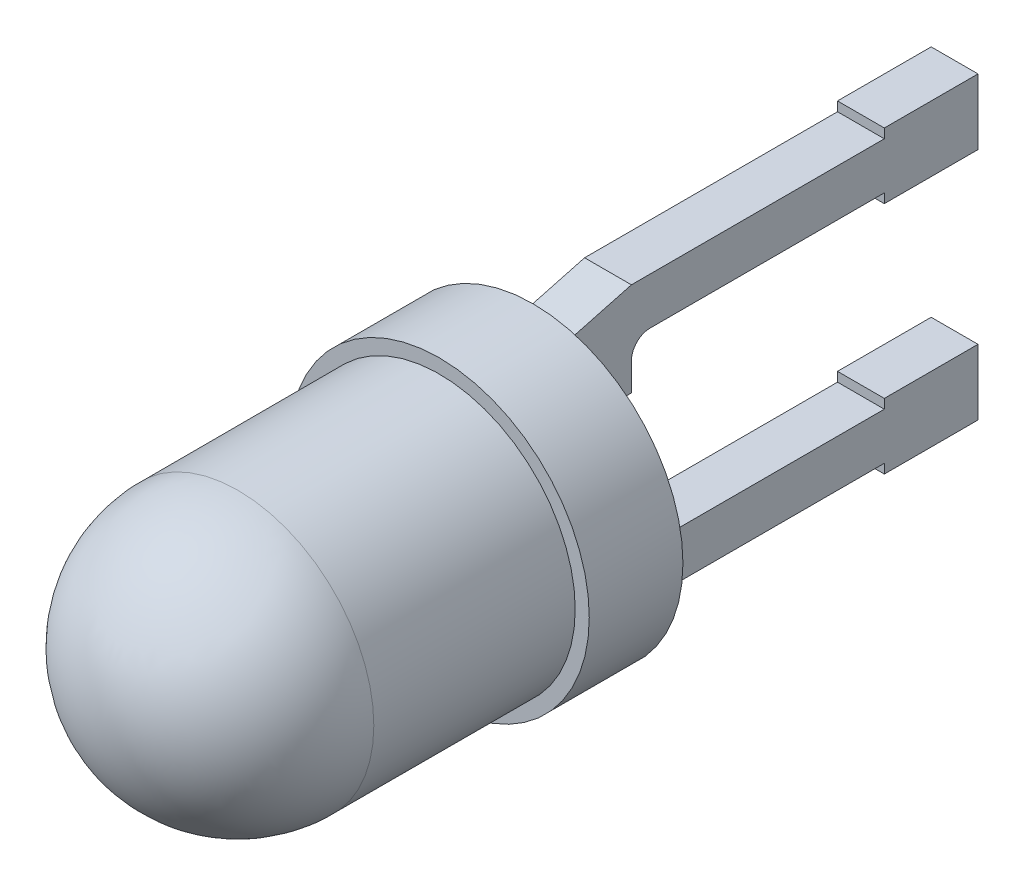
ISO-10303-21;
HEADER;
FILE_DESCRIPTION(('STEP AP214'),'2;1');
FILE_NAME('part.step','',(''),(''),'','','');
FILE_SCHEMA(('AUTOMOTIVE_DESIGN { 1 0 10303 214 1 1 1 1 }'));
ENDSEC;
DATA;
#1=APPLICATION_CONTEXT('core data for automotive mechanical design processes');
#2=APPLICATION_PROTOCOL_DEFINITION('international standard','automotive_design',2000,#1);
#3=PRODUCT_CONTEXT('',#1,'mechanical');
#4=PRODUCT('Part','Part','',(#3));
#5=PRODUCT_RELATED_PRODUCT_CATEGORY('part','',(#4));
#6=PRODUCT_DEFINITION_FORMATION('','',#4);
#7=PRODUCT_DEFINITION_CONTEXT('part definition',#1,'design');
#8=PRODUCT_DEFINITION('design','',#6,#7);
#9=PRODUCT_DEFINITION_SHAPE('','',#8);
#10=(LENGTH_UNIT() NAMED_UNIT(*) SI_UNIT(.MILLI.,.METRE.));
#11=(NAMED_UNIT(*) PLANE_ANGLE_UNIT() SI_UNIT($,.RADIAN.));
#12=(NAMED_UNIT(*) SI_UNIT($,.STERADIAN.) SOLID_ANGLE_UNIT());
#13=UNCERTAINTY_MEASURE_WITH_UNIT(LENGTH_MEASURE(1.E-05),#10,'distance_accuracy_value','');
#14=(GEOMETRIC_REPRESENTATION_CONTEXT(3) GLOBAL_UNCERTAINTY_ASSIGNED_CONTEXT((#13)) GLOBAL_UNIT_ASSIGNED_CONTEXT((#10,
#11,#12)) REPRESENTATION_CONTEXT('',''));
#15=CARTESIAN_POINT('',(0.,0.,0.));
#16=DIRECTION('',(0.,0.,1.));
#17=DIRECTION('',(1.,0.,0.));
#18=AXIS2_PLACEMENT_3D('',#15,#16,#17);
#19=CARTESIAN_POINT('',(-0.25,0.,0.));
#20=DIRECTION('',(-1.,0.,0.));
#21=DIRECTION('',(0.,0.,1.));
#22=AXIS2_PLACEMENT_3D('',#19,#20,#21);
#23=PLANE('',#22);
#24=DIRECTION('',(0.,0.,1.));
#25=VECTOR('',#24,1.);
#26=CARTESIAN_POINT('',(-0.25,-0.9000000004,0.));
#27=LINE('',#26,#25);
#28=CARTESIAN_POINT('',(-0.25,-0.900000000133333,-3.50000000033333));
#29=VERTEX_POINT('',#28);
#30=CARTESIAN_POINT('',(-0.25,-0.9000000004,-4.499999994));
#31=VERTEX_POINT('',#30);
#32=EDGE_CURVE('E264',#29,#31,#27,.F.);
#33=ORIENTED_EDGE('',*,*,#32,.T.);
#34=DIRECTION('',(0.,1.,0.));
#35=VECTOR('',#34,1.);
#36=CARTESIAN_POINT('',(-0.25,0.,-4.5));
#37=LINE('',#36,#35);
#38=CARTESIAN_POINT('',(-0.25,-1.6,-4.4999999985));
#39=VERTEX_POINT('',#38);
#40=EDGE_CURVE('E312',#39,#31,#37,.T.);
#41=ORIENTED_EDGE('',*,*,#40,.F.);
#42=DIRECTION('',(0.,0.,-1.));
#43=VECTOR('',#42,1.);
#44=CARTESIAN_POINT('',(-0.25,-1.6,0.));
#45=LINE('',#44,#43);
#46=CARTESIAN_POINT('',(-0.25,-1.6,-3.5000000005));
#47=VERTEX_POINT('',#46);
#48=EDGE_CURVE('E322',#47,#39,#45,.T.);
#49=ORIENTED_EDGE('',*,*,#48,.F.);
#50=DIRECTION('',(0.,1.,0.));
#51=VECTOR('',#50,1.);
#52=CARTESIAN_POINT('',(-0.25,0.,-3.5));
#53=LINE('',#52,#51);
#54=CARTESIAN_POINT('',(-0.25,-1.5,-3.50000000025));
#55=VERTEX_POINT('',#54);
#56=EDGE_CURVE('E329',#55,#47,#53,.F.);
#57=ORIENTED_EDGE('',*,*,#56,.F.);
#58=DIRECTION('',(0.,0.,-1.));
#59=VECTOR('',#58,1.);
#60=CARTESIAN_POINT('',(-0.25,-1.5,0.));
#61=LINE('',#60,#59);
#62=CARTESIAN_POINT('',(-0.25,-1.49999999985994,-0.799999999912528));
#63=VERTEX_POINT('',#62);
#64=EDGE_CURVE('E228',#63,#55,#61,.T.);
#65=ORIENTED_EDGE('',*,*,#64,.F.);
#66=DIRECTION('',(0.,0.258819045307522,0.965925826234139));
#67=VECTOR('',#66,1.);
#68=CARTESIAN_POINT('',(-0.25,-1.5,-0.7999999995));
#69=LINE('',#68,#67);
#70=CARTESIAN_POINT('',(-0.250000000325,-1.28564064567456,-6.9649347596202E-12));
#71=VERTEX_POINT('',#70);
#72=EDGE_CURVE('E262',#63,#71,#69,.T.);
#73=ORIENTED_EDGE('',*,*,#72,.T.);
#74=DIRECTION('',(0.,1.,0.));
#75=VECTOR('',#74,1.);
#76=CARTESIAN_POINT('',(-0.25,0.,2.649969133E-11));
#77=LINE('',#76,#75);
#78=CARTESIAN_POINT('',(-0.25,-0.5,2.649969133E-11));
#79=VERTEX_POINT('',#78);
#80=EDGE_CURVE('E244',#71,#79,#77,.T.);
#81=ORIENTED_EDGE('',*,*,#80,.T.);
#82=DIRECTION('',(0.,0.,1.));
#83=VECTOR('',#82,1.);
#84=CARTESIAN_POINT('',(-0.25,-0.5,0.));
#85=LINE('',#84,#83);
#86=CARTESIAN_POINT('',(-0.25,-0.5,-0.799999999833333));
#87=VERTEX_POINT('',#86);
#88=EDGE_CURVE('E225',#79,#87,#85,.F.);
#89=ORIENTED_EDGE('',*,*,#88,.T.);
#90=DIRECTION('',(0.,1.,0.));
#91=VECTOR('',#90,1.);
#92=CARTESIAN_POINT('',(-0.25,0.,-0.8));
#93=LINE('',#92,#91);
#94=CARTESIAN_POINT('',(-0.25,-0.8,-0.8));
#95=VERTEX_POINT('',#94);
#96=EDGE_CURVE('E219',#95,#87,#93,.T.);
#97=ORIENTED_EDGE('',*,*,#96,.F.);
#98=CARTESIAN_POINT('',(-0.25,-0.8,-1.));
#99=DIRECTION('',(-1.,0.,0.));
#100=DIRECTION('',(0.,0.,1.));
#101=AXIS2_PLACEMENT_3D('',#98,#99,#100);
#102=CIRCLE('',#101,0.2);
#103=CARTESIAN_POINT('',(-0.25,-1.,-1.));
#104=VERTEX_POINT('',#103);
#105=EDGE_CURVE('E206',#95,#104,#102,.F.);
#106=ORIENTED_EDGE('',*,*,#105,.T.);
#107=DIRECTION('',(0.,0.,1.));
#108=VECTOR('',#107,1.);
#109=CARTESIAN_POINT('',(-0.25,-1.,0.));
#110=LINE('',#109,#108);
#111=CARTESIAN_POINT('',(-0.25,-1.,-3.5));
#112=VERTEX_POINT('',#111);
#113=EDGE_CURVE('E200',#112,#104,#110,.T.);
#114=ORIENTED_EDGE('',*,*,#113,.F.);
#115=DIRECTION('',(0.,1.,0.));
#116=VECTOR('',#115,1.);
#117=CARTESIAN_POINT('',(-0.25,0.,-3.5));
#118=LINE('',#117,#116);
#119=EDGE_CURVE('E238',#29,#112,#118,.F.);
#120=ORIENTED_EDGE('',*,*,#119,.F.);
#121=EDGE_LOOP('',(#33,#41,#49,#57,#65,#73,#81,#89,#97,#106,#114,#120));
#122=FACE_BOUND('',#121,.T.);
#123=ADVANCED_FACE('F38',(#122),#23,.T.);
#124=CARTESIAN_POINT('',(-0.25,0.,0.));
#125=DIRECTION('',(-1.,0.,0.));
#126=DIRECTION('',(0.,0.,1.));
#127=AXIS2_PLACEMENT_3D('',#124,#125,#126);
#128=PLANE('',#127);
#129=DIRECTION('',(0.,1.,0.));
#130=VECTOR('',#129,1.);
#131=CARTESIAN_POINT('',(-0.25,0.,-4.5));
#132=LINE('',#131,#130);
#133=CARTESIAN_POINT('',(-0.25,0.9000000001,-4.50000000225));
#134=VERTEX_POINT('',#133);
#135=CARTESIAN_POINT('',(-0.25,1.6,-4.5000000045));
#136=VERTEX_POINT('',#135);
#137=EDGE_CURVE('E396',#134,#136,#132,.T.);
#138=ORIENTED_EDGE('',*,*,#137,.F.);
#139=DIRECTION('',(0.,0.,-1.));
#140=VECTOR('',#139,1.);
#141=CARTESIAN_POINT('',(-0.25,0.9,0.));
#142=LINE('',#141,#140);
#143=CARTESIAN_POINT('',(-0.25,0.9000000002,-3.500000005));
#144=VERTEX_POINT('',#143);
#145=EDGE_CURVE('E255',#144,#134,#142,.T.);
#146=ORIENTED_EDGE('',*,*,#145,.F.);
#147=DIRECTION('',(0.,1.,0.));
#148=VECTOR('',#147,1.);
#149=CARTESIAN_POINT('',(-0.25,0.,-3.5));
#150=LINE('',#149,#148);
#151=CARTESIAN_POINT('',(-0.25,1.00000000016667,-3.50000000166667));
#152=VERTEX_POINT('',#151);
#153=EDGE_CURVE('E253',#152,#144,#150,.F.);
#154=ORIENTED_EDGE('',*,*,#153,.F.);
#155=DIRECTION('',(0.,0.,-1.));
#156=VECTOR('',#155,1.);
#157=CARTESIAN_POINT('',(-0.25,1.,0.));
#158=LINE('',#157,#156);
#159=CARTESIAN_POINT('',(-0.25,1.,-1.));
#160=VERTEX_POINT('',#159);
#161=EDGE_CURVE('E247',#160,#152,#158,.T.);
#162=ORIENTED_EDGE('',*,*,#161,.F.);
#163=CARTESIAN_POINT('',(-0.25,0.8,-1.));
#164=DIRECTION('',(1.,0.,0.));
#165=DIRECTION('',(0.,0.,-1.));
#166=AXIS2_PLACEMENT_3D('',#163,#164,#165);
#167=CIRCLE('',#166,0.2);
#168=CARTESIAN_POINT('',(-0.25,0.8,-0.800000005));
#169=VERTEX_POINT('',#168);
#170=EDGE_CURVE('E280',#160,#169,#167,.T.);
#171=ORIENTED_EDGE('',*,*,#170,.T.);
#172=DIRECTION('',(0.,1.,0.));
#173=VECTOR('',#172,1.);
#174=CARTESIAN_POINT('',(-0.25,0.,-0.80000001));
#175=LINE('',#174,#173);
#176=CARTESIAN_POINT('',(-0.25,0.5,-0.800000005));
#177=VERTEX_POINT('',#176);
#178=EDGE_CURVE('E242',#169,#177,#175,.F.);
#179=ORIENTED_EDGE('',*,*,#178,.T.);
#180=DIRECTION('',(0.,0.,1.));
#181=VECTOR('',#180,1.);
#182=CARTESIAN_POINT('',(-0.25,0.5,0.));
#183=LINE('',#182,#181);
#184=CARTESIAN_POINT('',(-0.250000000325,0.499999999825,1.399946825E-11));
#185=VERTEX_POINT('',#184);
#186=EDGE_CURVE('E241',#177,#185,#183,.T.);
#187=ORIENTED_EDGE('',*,*,#186,.T.);
#188=DIRECTION('',(0.,1.,0.));
#189=VECTOR('',#188,1.);
#190=CARTESIAN_POINT('',(-0.25,0.,2.79989365E-11));
#191=LINE('',#190,#189);
#192=CARTESIAN_POINT('',(-0.250000000325,1.28564064567445,-5.80333535264917E-12));
#193=VERTEX_POINT('',#192);
#194=EDGE_CURVE('E239',#185,#193,#191,.T.);
#195=ORIENTED_EDGE('',*,*,#194,.T.);
#196=DIRECTION('',(0.,0.258819042137625,-0.96592582708351));
#197=VECTOR('',#196,1.);
#198=CARTESIAN_POINT('',(-0.25,1.285640646,2.79989365E-11));
#199=LINE('',#198,#197);
#200=CARTESIAN_POINT('',(-0.25,1.49999999992997,-0.800000005018764));
#201=VERTEX_POINT('',#200);
#202=EDGE_CURVE('E236',#193,#201,#199,.T.);
#203=ORIENTED_EDGE('',*,*,#202,.T.);
#204=DIRECTION('',(0.,0.,1.));
#205=VECTOR('',#204,1.);
#206=CARTESIAN_POINT('',(-0.25,1.5,0.));
#207=LINE('',#206,#205);
#208=CARTESIAN_POINT('',(-0.25,1.5,-3.5000000025));
#209=VERTEX_POINT('',#208);
#210=EDGE_CURVE('E380',#209,#201,#207,.T.);
#211=ORIENTED_EDGE('',*,*,#210,.F.);
#212=DIRECTION('',(0.,1.,0.));
#213=VECTOR('',#212,1.);
#214=CARTESIAN_POINT('',(-0.25,0.,-3.5));
#215=LINE('',#214,#213);
#216=CARTESIAN_POINT('',(-0.25,1.6,-3.5000000025));
#217=VERTEX_POINT('',#216);
#218=EDGE_CURVE('E386',#217,#209,#215,.F.);
#219=ORIENTED_EDGE('',*,*,#218,.F.);
#220=DIRECTION('',(0.,0.,1.));
#221=VECTOR('',#220,1.);
#222=CARTESIAN_POINT('',(-0.25,1.6,0.));
#223=LINE('',#222,#221);
#224=EDGE_CURVE('E394',#136,#217,#223,.T.);
#225=ORIENTED_EDGE('',*,*,#224,.F.);
#226=EDGE_LOOP('',(#138,#146,#154,#162,#171,#179,#187,#195,#203,#211,#219,#225));
#227=FACE_BOUND('',#226,.T.);
#228=ADVANCED_FACE('F483',(#227),#128,.T.);
#229=CARTESIAN_POINT('',(0.,0.,-3.5));
#230=DIRECTION('',(0.,0.,1.));
#231=DIRECTION('',(1.,0.,0.));
#232=AXIS2_PLACEMENT_3D('',#229,#230,#231);
#233=PLANE('',#232);
#234=DIRECTION('',(1.,0.,0.));
#235=VECTOR('',#234,1.);
#236=CARTESIAN_POINT('',(0.,-1.,-3.5));
#237=LINE('',#236,#235);
#238=CARTESIAN_POINT('',(0.25,-1.,-3.50000000066667));
#239=VERTEX_POINT('',#238);
#240=EDGE_CURVE('E259',#239,#112,#237,.F.);
#241=ORIENTED_EDGE('',*,*,#240,.F.);
#242=DIRECTION('',(0.,1.,0.));
#243=VECTOR('',#242,1.);
#244=CARTESIAN_POINT('',(0.25,0.,-3.500000001));
#245=LINE('',#244,#243);
#246=CARTESIAN_POINT('',(0.25,-0.9000000002,-3.50000000066667));
#247=VERTEX_POINT('',#246);
#248=EDGE_CURVE('E337',#247,#239,#245,.F.);
#249=ORIENTED_EDGE('',*,*,#248,.F.);
#250=DIRECTION('',(1.,0.,0.));
#251=VECTOR('',#250,1.);
#252=CARTESIAN_POINT('',(0.,-0.9,-3.5));
#253=LINE('',#252,#251);
#254=EDGE_CURVE('E281',#29,#247,#253,.T.);
#255=ORIENTED_EDGE('',*,*,#254,.F.);
#256=ORIENTED_EDGE('',*,*,#119,.T.);
#257=EDGE_LOOP('',(#241,#249,#255,#256));
#258=FACE_BOUND('',#257,.T.);
#259=ADVANCED_FACE('F707',(#258),#233,.T.);
#260=CARTESIAN_POINT('',(0.,-1.,0.));
#261=DIRECTION('',(0.,1.,0.));
#262=DIRECTION('',(0.,0.,1.));
#263=AXIS2_PLACEMENT_3D('',#260,#261,#262);
#264=PLANE('',#263);
#265=DIRECTION('',(-1.,0.,0.));
#266=VECTOR('',#265,1.);
#267=CARTESIAN_POINT('',(0.,-1.,-1.));
#268=LINE('',#267,#266);
#269=CARTESIAN_POINT('',(0.25,-1.,-1.));
#270=VERTEX_POINT('',#269);
#271=EDGE_CURVE('E211',#104,#270,#268,.F.);
#272=ORIENTED_EDGE('',*,*,#271,.T.);
#273=DIRECTION('',(0.,0.,-1.));
#274=VECTOR('',#273,1.);
#275=CARTESIAN_POINT('',(0.25,-1.,0.));
#276=LINE('',#275,#274);
#277=EDGE_CURVE('E310',#239,#270,#276,.F.);
#278=ORIENTED_EDGE('',*,*,#277,.F.);
#279=ORIENTED_EDGE('',*,*,#240,.T.);
#280=ORIENTED_EDGE('',*,*,#113,.T.);
#281=EDGE_LOOP('',(#272,#278,#279,#280));
#282=FACE_BOUND('',#281,.T.);
#283=ADVANCED_FACE('F698',(#282),#264,.T.);
#284=CARTESIAN_POINT('',(0.25,-0.8,-1.));
#285=DIRECTION('',(-1.,0.,0.));
#286=DIRECTION('',(0.,0.,1.));
#287=AXIS2_PLACEMENT_3D('',#284,#285,#286);
#288=CYLINDRICAL_SURFACE('',#287,0.2);
#289=ORIENTED_EDGE('',*,*,#271,.F.);
#290=ORIENTED_EDGE('',*,*,#105,.F.);
#291=DIRECTION('',(-1.,0.,0.));
#292=VECTOR('',#291,1.);
#293=CARTESIAN_POINT('',(0.,-0.8,-0.8));
#294=LINE('',#293,#292);
#295=CARTESIAN_POINT('',(0.25,-0.8,-0.79999999975));
#296=VERTEX_POINT('',#295);
#297=EDGE_CURVE('E209',#296,#95,#294,.T.);
#298=ORIENTED_EDGE('',*,*,#297,.F.);
#299=CARTESIAN_POINT('',(0.25,-0.8,-1.));
#300=DIRECTION('',(-1.,0.,0.));
#301=DIRECTION('',(0.,0.,1.));
#302=AXIS2_PLACEMENT_3D('',#299,#300,#301);
#303=CIRCLE('',#302,0.2);
#304=EDGE_CURVE('E308',#270,#296,#303,.T.);
#305=ORIENTED_EDGE('',*,*,#304,.F.);
#306=EDGE_LOOP('',(#289,#290,#298,#305));
#307=FACE_BOUND('',#306,.T.);
#308=ADVANCED_FACE('F208',(#307),#288,.F.);
#309=CARTESIAN_POINT('',(0.,0.,-0.8));
#310=DIRECTION('',(0.,0.,-1.));
#311=DIRECTION('',(-1.,0.,0.));
#312=AXIS2_PLACEMENT_3D('',#309,#310,#311);
#313=PLANE('',#312);
#314=ORIENTED_EDGE('',*,*,#297,.T.);
#315=ORIENTED_EDGE('',*,*,#96,.T.);
#316=DIRECTION('',(1.,0.,0.));
#317=VECTOR('',#316,1.);
#318=CARTESIAN_POINT('',(0.,-0.5,-0.8));
#319=LINE('',#318,#317);
#320=CARTESIAN_POINT('',(0.25,-0.5,-0.799999999666667));
#321=VERTEX_POINT('',#320);
#322=EDGE_CURVE('E335',#321,#87,#319,.F.);
#323=ORIENTED_EDGE('',*,*,#322,.F.);
#324=DIRECTION('',(0.,1.,0.));
#325=VECTOR('',#324,1.);
#326=CARTESIAN_POINT('',(0.25,0.,-0.7999999995));
#327=LINE('',#326,#325);
#328=EDGE_CURVE('E221',#296,#321,#327,.T.);
#329=ORIENTED_EDGE('',*,*,#328,.F.);
#330=EDGE_LOOP('',(#314,#315,#323,#329));
#331=FACE_BOUND('',#330,.T.);
#332=ADVANCED_FACE('F217',(#331),#313,.T.);
#333=CARTESIAN_POINT('',(0.,-1.5,0.));
#334=DIRECTION('',(0.,-1.,0.));
#335=DIRECTION('',(0.,0.,-1.));
#336=AXIS2_PLACEMENT_3D('',#333,#334,#335);
#337=PLANE('',#336);
#338=DIRECTION('',(1.,0.,0.));
#339=VECTOR('',#338,1.);
#340=CARTESIAN_POINT('',(0.,-1.5,-3.5));
#341=LINE('',#340,#339);
#342=CARTESIAN_POINT('',(0.25,-1.5,-3.50000000025));
#343=VERTEX_POINT('',#342);
#344=EDGE_CURVE('E331',#343,#55,#341,.F.);
#345=ORIENTED_EDGE('',*,*,#344,.F.);
#346=DIRECTION('',(0.,0.,-1.));
#347=VECTOR('',#346,1.);
#348=CARTESIAN_POINT('',(0.25,-1.5,0.));
#349=LINE('',#348,#347);
#350=CARTESIAN_POINT('',(0.25,-1.49999999992997,-0.799999999893764));
#351=VERTEX_POINT('',#350);
#352=EDGE_CURVE('E343',#351,#343,#349,.T.);
#353=ORIENTED_EDGE('',*,*,#352,.F.);
#354=DIRECTION('',(1.,0.,0.));
#355=VECTOR('',#354,1.);
#356=CARTESIAN_POINT('',(0.,-1.5,-0.8));
#357=LINE('',#356,#355);
#358=EDGE_CURVE('E226',#351,#63,#357,.F.);
#359=ORIENTED_EDGE('',*,*,#358,.T.);
#360=ORIENTED_EDGE('',*,*,#64,.T.);
#361=EDGE_LOOP('',(#345,#353,#359,#360));
#362=FACE_BOUND('',#361,.T.);
#363=ADVANCED_FACE('F671',(#362),#337,.T.);
#364=CARTESIAN_POINT('',(0.,0.,-3.5));
#365=DIRECTION('',(0.,0.,1.));
#366=DIRECTION('',(1.,0.,0.));
#367=AXIS2_PLACEMENT_3D('',#364,#365,#366);
#368=PLANE('',#367);
#369=ORIENTED_EDGE('',*,*,#344,.T.);
#370=ORIENTED_EDGE('',*,*,#56,.T.);
#371=DIRECTION('',(1.,0.,0.));
#372=VECTOR('',#371,1.);
#373=CARTESIAN_POINT('',(0.,-1.6,-3.5));
#374=LINE('',#373,#372);
#375=CARTESIAN_POINT('',(0.25,-1.6,-3.50000000025));
#376=VERTEX_POINT('',#375);
#377=EDGE_CURVE('E318',#376,#47,#374,.F.);
#378=ORIENTED_EDGE('',*,*,#377,.F.);
#379=DIRECTION('',(0.,1.,0.));
#380=VECTOR('',#379,1.);
#381=CARTESIAN_POINT('',(0.25,0.,-3.500000001));
#382=LINE('',#381,#380);
#383=EDGE_CURVE('E367',#343,#376,#382,.F.);
#384=ORIENTED_EDGE('',*,*,#383,.F.);
#385=EDGE_LOOP('',(#369,#370,#378,#384));
#386=FACE_BOUND('',#385,.T.);
#387=ADVANCED_FACE('F661',(#386),#368,.T.);
#388=CARTESIAN_POINT('',(0.,-1.6,0.));
#389=DIRECTION('',(0.,-1.,0.));
#390=DIRECTION('',(0.,0.,-1.));
#391=AXIS2_PLACEMENT_3D('',#388,#389,#390);
#392=PLANE('',#391);
#393=DIRECTION('',(0.,0.,-1.));
#394=VECTOR('',#393,1.);
#395=CARTESIAN_POINT('',(0.25,-1.6,0.));
#396=LINE('',#395,#394);
#397=CARTESIAN_POINT('',(0.25,-1.6,-4.4999999985));
#398=VERTEX_POINT('',#397);
#399=EDGE_CURVE('E364',#376,#398,#396,.T.);
#400=ORIENTED_EDGE('',*,*,#399,.F.);
#401=ORIENTED_EDGE('',*,*,#377,.T.);
#402=ORIENTED_EDGE('',*,*,#48,.T.);
#403=DIRECTION('',(-1.,0.,0.));
#404=VECTOR('',#403,1.);
#405=CARTESIAN_POINT('',(0.,-1.6,-4.5));
#406=LINE('',#405,#404);
#407=EDGE_CURVE('E313',#398,#39,#406,.T.);
#408=ORIENTED_EDGE('',*,*,#407,.F.);
#409=EDGE_LOOP('',(#400,#401,#402,#408));
#410=FACE_BOUND('',#409,.T.);
#411=ADVANCED_FACE('F653',(#410),#392,.T.);
#412=CARTESIAN_POINT('',(0.,0.,-4.5));
#413=DIRECTION('',(0.,0.,-1.));
#414=DIRECTION('',(-1.,0.,0.));
#415=AXIS2_PLACEMENT_3D('',#412,#413,#414);
#416=PLANE('',#415);
#417=DIRECTION('',(0.,1.,0.));
#418=VECTOR('',#417,1.);
#419=CARTESIAN_POINT('',(0.25,0.,-4.499999994));
#420=LINE('',#419,#418);
#421=CARTESIAN_POINT('',(0.25,-0.9000000001,-4.4999999985));
#422=VERTEX_POINT('',#421);
#423=EDGE_CURVE('E357',#398,#422,#420,.T.);
#424=ORIENTED_EDGE('',*,*,#423,.F.);
#425=ORIENTED_EDGE('',*,*,#407,.T.);
#426=ORIENTED_EDGE('',*,*,#40,.T.);
#427=DIRECTION('',(1.,0.,0.));
#428=VECTOR('',#427,1.);
#429=CARTESIAN_POINT('',(0.,-0.9,-4.5));
#430=LINE('',#429,#428);
#431=EDGE_CURVE('E277',#422,#31,#430,.F.);
#432=ORIENTED_EDGE('',*,*,#431,.F.);
#433=EDGE_LOOP('',(#424,#425,#426,#432));
#434=FACE_BOUND('',#433,.T.);
#435=ADVANCED_FACE('F642',(#434),#416,.T.);
#436=CARTESIAN_POINT('',(0.,-0.9,0.));
#437=DIRECTION('',(0.,1.,0.));
#438=DIRECTION('',(0.,0.,1.));
#439=AXIS2_PLACEMENT_3D('',#436,#437,#438);
#440=PLANE('',#439);
#441=DIRECTION('',(0.,0.,-1.));
#442=VECTOR('',#441,1.);
#443=CARTESIAN_POINT('',(0.25,-0.9000000004,0.));
#444=LINE('',#443,#442);
#445=EDGE_CURVE('E353',#422,#247,#444,.F.);
#446=ORIENTED_EDGE('',*,*,#445,.F.);
#447=ORIENTED_EDGE('',*,*,#431,.T.);
#448=ORIENTED_EDGE('',*,*,#32,.F.);
#449=ORIENTED_EDGE('',*,*,#254,.T.);
#450=EDGE_LOOP('',(#446,#447,#448,#449));
#451=FACE_BOUND('',#450,.T.);
#452=ADVANCED_FACE('F633',(#451),#440,.T.);
#453=CARTESIAN_POINT('',(-0.25,0.8,-1.));
#454=DIRECTION('',(1.,0.,0.));
#455=DIRECTION('',(0.,0.,-1.));
#456=AXIS2_PLACEMENT_3D('',#453,#454,#455);
#457=CYLINDRICAL_SURFACE('',#456,0.2);
#458=DIRECTION('',(1.,0.,0.));
#459=VECTOR('',#458,1.);
#460=CARTESIAN_POINT('',(0.,1.,-1.));
#461=LINE('',#460,#459);
#462=CARTESIAN_POINT('',(0.25,1.0000000005,-1.));
#463=VERTEX_POINT('',#462);
#464=EDGE_CURVE('E250',#463,#160,#461,.F.);
#465=ORIENTED_EDGE('',*,*,#464,.F.);
#466=CARTESIAN_POINT('',(0.25,0.8,-1.));
#467=DIRECTION('',(1.,0.,0.));
#468=DIRECTION('',(0.,0.,-1.));
#469=AXIS2_PLACEMENT_3D('',#466,#467,#468);
#470=CIRCLE('',#469,0.2);
#471=CARTESIAN_POINT('',(0.25,0.8,-0.800000005));
#472=VERTEX_POINT('',#471);
#473=EDGE_CURVE('E304',#472,#463,#470,.F.);
#474=ORIENTED_EDGE('',*,*,#473,.F.);
#475=DIRECTION('',(-1.,0.,0.));
#476=VECTOR('',#475,1.);
#477=CARTESIAN_POINT('',(0.,0.8,-0.8));
#478=LINE('',#477,#476);
#479=EDGE_CURVE('E338',#169,#472,#478,.F.);
#480=ORIENTED_EDGE('',*,*,#479,.F.);
#481=ORIENTED_EDGE('',*,*,#170,.F.);
#482=EDGE_LOOP('',(#465,#474,#480,#481));
#483=FACE_BOUND('',#482,.T.);
#484=ADVANCED_FACE('F493',(#483),#457,.F.);
#485=CARTESIAN_POINT('',(0.,1.,0.));
#486=DIRECTION('',(0.,-1.,0.));
#487=DIRECTION('',(0.,0.,-1.));
#488=AXIS2_PLACEMENT_3D('',#485,#486,#487);
#489=PLANE('',#488);
#490=ORIENTED_EDGE('',*,*,#464,.T.);
#491=ORIENTED_EDGE('',*,*,#161,.T.);
#492=DIRECTION('',(1.,0.,0.));
#493=VECTOR('',#492,1.);
#494=CARTESIAN_POINT('',(0.,1.,-3.5));
#495=LINE('',#494,#493);
#496=CARTESIAN_POINT('',(0.25,1.00000000066667,-3.50000000666667));
#497=VERTEX_POINT('',#496);
#498=EDGE_CURVE('E249',#497,#152,#495,.F.);
#499=ORIENTED_EDGE('',*,*,#498,.F.);
#500=DIRECTION('',(0.,0.,-1.));
#501=VECTOR('',#500,1.);
#502=CARTESIAN_POINT('',(0.25,1.000000001,0.));
#503=LINE('',#502,#501);
#504=EDGE_CURVE('E306',#463,#497,#503,.T.);
#505=ORIENTED_EDGE('',*,*,#504,.F.);
#506=EDGE_LOOP('',(#490,#491,#499,#505));
#507=FACE_BOUND('',#506,.T.);
#508=ADVANCED_FACE('F495',(#507),#489,.T.);
#509=CARTESIAN_POINT('',(0.,0.,-3.5));
#510=DIRECTION('',(0.,0.,1.));
#511=DIRECTION('',(1.,0.,0.));
#512=AXIS2_PLACEMENT_3D('',#509,#510,#511);
#513=PLANE('',#512);
#514=ORIENTED_EDGE('',*,*,#498,.T.);
#515=ORIENTED_EDGE('',*,*,#153,.T.);
#516=DIRECTION('',(1.,0.,0.));
#517=VECTOR('',#516,1.);
#518=CARTESIAN_POINT('',(0.,0.9,-3.5));
#519=LINE('',#518,#517);
#520=CARTESIAN_POINT('',(0.25,0.9000000001,-3.5000000025));
#521=VERTEX_POINT('',#520);
#522=EDGE_CURVE('E401',#521,#144,#519,.F.);
#523=ORIENTED_EDGE('',*,*,#522,.F.);
#524=DIRECTION('',(0.,1.,0.));
#525=VECTOR('',#524,1.);
#526=CARTESIAN_POINT('',(0.25,0.,-3.50000001));
#527=LINE('',#526,#525);
#528=EDGE_CURVE('E412',#497,#521,#527,.F.);
#529=ORIENTED_EDGE('',*,*,#528,.F.);
#530=EDGE_LOOP('',(#514,#515,#523,#529));
#531=FACE_BOUND('',#530,.T.);
#532=ADVANCED_FACE('F500',(#531),#513,.T.);
#533=CARTESIAN_POINT('',(0.,0.9,0.));
#534=DIRECTION('',(0.,-1.,0.));
#535=DIRECTION('',(0.,0.,-1.));
#536=AXIS2_PLACEMENT_3D('',#533,#534,#535);
#537=PLANE('',#536);
#538=DIRECTION('',(0.,0.,-1.));
#539=VECTOR('',#538,1.);
#540=CARTESIAN_POINT('',(0.25,0.9000000004,0.));
#541=LINE('',#540,#539);
#542=CARTESIAN_POINT('',(0.25,0.9000000001,-4.50000000225));
#543=VERTEX_POINT('',#542);
#544=EDGE_CURVE('E414',#521,#543,#541,.T.);
#545=ORIENTED_EDGE('',*,*,#544,.F.);
#546=ORIENTED_EDGE('',*,*,#522,.T.);
#547=ORIENTED_EDGE('',*,*,#145,.T.);
#548=DIRECTION('',(-1.,0.,0.));
#549=VECTOR('',#548,1.);
#550=CARTESIAN_POINT('',(0.,0.9,-4.5));
#551=LINE('',#550,#549);
#552=EDGE_CURVE('E398',#543,#134,#551,.T.);
#553=ORIENTED_EDGE('',*,*,#552,.F.);
#554=EDGE_LOOP('',(#545,#546,#547,#553));
#555=FACE_BOUND('',#554,.T.);
#556=ADVANCED_FACE('F505',(#555),#537,.T.);
#557=CARTESIAN_POINT('',(0.,0.,-4.5));
#558=DIRECTION('',(0.,0.,-1.));
#559=DIRECTION('',(-1.,0.,0.));
#560=AXIS2_PLACEMENT_3D('',#557,#558,#559);
#561=PLANE('',#560);
#562=DIRECTION('',(0.,1.,0.));
#563=VECTOR('',#562,1.);
#564=CARTESIAN_POINT('',(0.25,0.,-4.500000009));
#565=LINE('',#564,#563);
#566=CARTESIAN_POINT('',(0.25,1.6,-4.50000000225));
#567=VERTEX_POINT('',#566);
#568=EDGE_CURVE('E463',#543,#567,#565,.T.);
#569=ORIENTED_EDGE('',*,*,#568,.F.);
#570=ORIENTED_EDGE('',*,*,#552,.T.);
#571=ORIENTED_EDGE('',*,*,#137,.T.);
#572=DIRECTION('',(1.,0.,0.));
#573=VECTOR('',#572,1.);
#574=CARTESIAN_POINT('',(0.,1.6,-4.5));
#575=LINE('',#574,#573);
#576=EDGE_CURVE('E391',#567,#136,#575,.F.);
#577=ORIENTED_EDGE('',*,*,#576,.F.);
#578=EDGE_LOOP('',(#569,#570,#571,#577));
#579=FACE_BOUND('',#578,.T.);
#580=ADVANCED_FACE('F508',(#579),#561,.T.);
#581=CARTESIAN_POINT('',(0.,1.6,0.));
#582=DIRECTION('',(0.,1.,0.));
#583=DIRECTION('',(0.,0.,1.));
#584=AXIS2_PLACEMENT_3D('',#581,#582,#583);
#585=PLANE('',#584);
#586=DIRECTION('',(0.,0.,-1.));
#587=VECTOR('',#586,1.);
#588=CARTESIAN_POINT('',(0.25,1.6,0.));
#589=LINE('',#588,#587);
#590=CARTESIAN_POINT('',(0.25,1.6,-3.5000000025));
#591=VERTEX_POINT('',#590);
#592=EDGE_CURVE('E461',#567,#591,#589,.F.);
#593=ORIENTED_EDGE('',*,*,#592,.F.);
#594=ORIENTED_EDGE('',*,*,#576,.T.);
#595=ORIENTED_EDGE('',*,*,#224,.T.);
#596=DIRECTION('',(1.,0.,0.));
#597=VECTOR('',#596,1.);
#598=CARTESIAN_POINT('',(0.,1.6,-3.5));
#599=LINE('',#598,#597);
#600=EDGE_CURVE('E388',#591,#217,#599,.F.);
#601=ORIENTED_EDGE('',*,*,#600,.F.);
#602=EDGE_LOOP('',(#593,#594,#595,#601));
#603=FACE_BOUND('',#602,.T.);
#604=ADVANCED_FACE('F512',(#603),#585,.T.);
#605=CARTESIAN_POINT('',(0.,0.,-3.5));
#606=DIRECTION('',(0.,0.,1.));
#607=DIRECTION('',(1.,0.,0.));
#608=AXIS2_PLACEMENT_3D('',#605,#606,#607);
#609=PLANE('',#608);
#610=DIRECTION('',(1.,0.,0.));
#611=VECTOR('',#610,1.);
#612=CARTESIAN_POINT('',(0.,1.5,-3.5));
#613=LINE('',#612,#611);
#614=CARTESIAN_POINT('',(0.25,1.5,-3.5000000025));
#615=VERTEX_POINT('',#614);
#616=EDGE_CURVE('E383',#615,#209,#613,.F.);
#617=ORIENTED_EDGE('',*,*,#616,.F.);
#618=DIRECTION('',(0.,1.,0.));
#619=VECTOR('',#618,1.);
#620=CARTESIAN_POINT('',(0.25,0.,-3.50000001));
#621=LINE('',#620,#619);
#622=EDGE_CURVE('E459',#591,#615,#621,.F.);
#623=ORIENTED_EDGE('',*,*,#622,.F.);
#624=ORIENTED_EDGE('',*,*,#600,.T.);
#625=ORIENTED_EDGE('',*,*,#218,.T.);
#626=EDGE_LOOP('',(#617,#623,#624,#625));
#627=FACE_BOUND('',#626,.T.);
#628=ADVANCED_FACE('F515',(#627),#609,.T.);
#629=CARTESIAN_POINT('',(0.,1.5,0.));
#630=DIRECTION('',(0.,1.,0.));
#631=DIRECTION('',(0.,0.,1.));
#632=AXIS2_PLACEMENT_3D('',#629,#630,#631);
#633=PLANE('',#632);
#634=ORIENTED_EDGE('',*,*,#616,.T.);
#635=ORIENTED_EDGE('',*,*,#210,.T.);
#636=DIRECTION('',(1.,0.,0.));
#637=VECTOR('',#636,1.);
#638=CARTESIAN_POINT('',(0.,1.49999999971988,-0.800000000075058));
#639=LINE('',#638,#637);
#640=CARTESIAN_POINT('',(0.25,1.49999999992997,-0.800000002518764));
#641=VERTEX_POINT('',#640);
#642=EDGE_CURVE('E362',#641,#201,#639,.F.);
#643=ORIENTED_EDGE('',*,*,#642,.F.);
#644=DIRECTION('',(0.,0.,-1.));
#645=VECTOR('',#644,1.);
#646=CARTESIAN_POINT('',(0.25,1.5,0.));
#647=LINE('',#646,#645);
#648=EDGE_CURVE('E457',#615,#641,#647,.F.);
#649=ORIENTED_EDGE('',*,*,#648,.F.);
#650=EDGE_LOOP('',(#634,#635,#643,#649));
#651=FACE_BOUND('',#650,.T.);
#652=ADVANCED_FACE('F478',(#651),#633,.T.);
#653=CARTESIAN_POINT('',(0.,0.,-0.8));
#654=DIRECTION('',(0.,0.,-1.));
#655=DIRECTION('',(-1.,0.,0.));
#656=AXIS2_PLACEMENT_3D('',#653,#654,#655);
#657=PLANE('',#656);
#658=ORIENTED_EDGE('',*,*,#479,.T.);
#659=DIRECTION('',(0.,1.,0.));
#660=VECTOR('',#659,1.);
#661=CARTESIAN_POINT('',(0.25,0.,-0.80000001));
#662=LINE('',#661,#660);
#663=CARTESIAN_POINT('',(0.25,0.5,-0.80000001));
#664=VERTEX_POINT('',#663);
#665=EDGE_CURVE('E307',#664,#472,#662,.T.);
#666=ORIENTED_EDGE('',*,*,#665,.F.);
#667=DIRECTION('',(1.,0.,0.));
#668=VECTOR('',#667,1.);
#669=CARTESIAN_POINT('',(0.,0.5,-0.8));
#670=LINE('',#669,#668);
#671=EDGE_CURVE('E419',#177,#664,#670,.T.);
#672=ORIENTED_EDGE('',*,*,#671,.F.);
#673=ORIENTED_EDGE('',*,*,#178,.F.);
#674=EDGE_LOOP('',(#658,#666,#672,#673));
#675=FACE_BOUND('',#674,.T.);
#676=ADVANCED_FACE('F488',(#675),#657,.T.);
#677=CARTESIAN_POINT('',(0.,-0.5,0.));
#678=DIRECTION('',(0.,1.,0.));
#679=DIRECTION('',(0.,0.,1.));
#680=AXIS2_PLACEMENT_3D('',#677,#678,#679);
#681=PLANE('',#680);
#682=DIRECTION('',(1.,0.,0.));
#683=VECTOR('',#682,1.);
#684=CARTESIAN_POINT('',(0.,-0.4999999993,0.));
#685=LINE('',#684,#683);
#686=CARTESIAN_POINT('',(0.250000000325,-0.499999999825,9.00002295E-13));
#687=VERTEX_POINT('',#686);
#688=EDGE_CURVE('E287',#79,#687,#685,.T.);
#689=ORIENTED_EDGE('',*,*,#688,.T.);
#690=DIRECTION('',(0.,0.,-1.));
#691=VECTOR('',#690,1.);
#692=CARTESIAN_POINT('',(0.25,-0.5,0.));
#693=LINE('',#692,#691);
#694=EDGE_CURVE('E341',#321,#687,#693,.F.);
#695=ORIENTED_EDGE('',*,*,#694,.F.);
#696=ORIENTED_EDGE('',*,*,#322,.T.);
#697=ORIENTED_EDGE('',*,*,#88,.F.);
#698=EDGE_LOOP('',(#689,#695,#696,#697));
#699=FACE_BOUND('',#698,.T.);
#700=ADVANCED_FACE('F564',(#699),#681,.T.);
#701=CARTESIAN_POINT('',(0.25,0.,0.));
#702=DIRECTION('',(1.,0.,0.));
#703=DIRECTION('',(0.,0.,-1.));
#704=AXIS2_PLACEMENT_3D('',#701,#702,#703);
#705=PLANE('',#704);
#706=ORIENTED_EDGE('',*,*,#399,.T.);
#707=ORIENTED_EDGE('',*,*,#423,.T.);
#708=ORIENTED_EDGE('',*,*,#445,.T.);
#709=ORIENTED_EDGE('',*,*,#248,.T.);
#710=ORIENTED_EDGE('',*,*,#277,.T.);
#711=ORIENTED_EDGE('',*,*,#304,.T.);
#712=ORIENTED_EDGE('',*,*,#328,.T.);
#713=ORIENTED_EDGE('',*,*,#694,.T.);
#714=DIRECTION('',(0.,1.,0.));
#715=VECTOR('',#714,1.);
#716=CARTESIAN_POINT('',(0.2500000013,0.,0.));
#717=LINE('',#716,#715);
#718=CARTESIAN_POINT('',(0.250000000325,-1.28564064567456,-2.02148072044571E-11));
#719=VERTEX_POINT('',#718);
#720=EDGE_CURVE('E290',#687,#719,#717,.F.);
#721=ORIENTED_EDGE('',*,*,#720,.T.);
#722=DIRECTION('',(0.,-0.258819045190737,-0.965925826265431));
#723=VECTOR('',#722,1.);
#724=CARTESIAN_POINT('',(0.25,-1.19951905242644,0.321410161520826));
#725=LINE('',#724,#723);
#726=EDGE_CURVE('E356',#351,#719,#725,.F.);
#727=ORIENTED_EDGE('',*,*,#726,.F.);
#728=ORIENTED_EDGE('',*,*,#352,.T.);
#729=ORIENTED_EDGE('',*,*,#383,.T.);
#730=EDGE_LOOP('',(#706,#707,#708,#709,#710,#711,#712,#713,#721,#727,#728,#729));
#731=FACE_BOUND('',#730,.T.);
#732=ADVANCED_FACE('F560',(#731),#705,.T.);
#733=CARTESIAN_POINT('',(0.,-1.19951905242644,0.321410161520826));
#734=DIRECTION('',(0.,-0.965925826265431,0.258819045190737));
#735=DIRECTION('',(0.,-0.258819045190737,-0.965925826265431));
#736=AXIS2_PLACEMENT_3D('',#733,#734,#735);
#737=PLANE('',#736);
#738=ORIENTED_EDGE('',*,*,#358,.F.);
#739=ORIENTED_EDGE('',*,*,#726,.T.);
#740=DIRECTION('',(1.,0.,0.));
#741=VECTOR('',#740,1.);
#742=CARTESIAN_POINT('',(0.,-1.285640645,0.));
#743=LINE('',#742,#741);
#744=EDGE_CURVE('E448',#719,#71,#743,.F.);
#745=ORIENTED_EDGE('',*,*,#744,.T.);
#746=ORIENTED_EDGE('',*,*,#72,.F.);
#747=EDGE_LOOP('',(#738,#739,#745,#746));
#748=FACE_BOUND('',#747,.T.);
#749=ADVANCED_FACE('F557',(#748),#737,.T.);
#750=CARTESIAN_POINT('',(0.,1.19951905242644,0.321410161520826));
#751=DIRECTION('',(0.,0.965925826265431,0.258819045190737));
#752=DIRECTION('',(0.,-0.258819045190737,0.965925826265431));
#753=AXIS2_PLACEMENT_3D('',#750,#751,#752);
#754=PLANE('',#753);
#755=ORIENTED_EDGE('',*,*,#642,.T.);
#756=ORIENTED_EDGE('',*,*,#202,.F.);
#757=DIRECTION('',(1.,0.,0.));
#758=VECTOR('',#757,1.);
#759=CARTESIAN_POINT('',(0.,1.285640645,0.));
#760=LINE('',#759,#758);
#761=CARTESIAN_POINT('',(0.250000000325,1.28564064559889,-3.96056343103524E-11));
#762=VERTEX_POINT('',#761);
#763=EDGE_CURVE('E446',#193,#762,#760,.T.);
#764=ORIENTED_EDGE('',*,*,#763,.T.);
#765=DIRECTION('',(0.,-0.258819042146076,0.965925827081245));
#766=VECTOR('',#765,1.);
#767=CARTESIAN_POINT('',(0.25,1.5,-0.80000001));
#768=LINE('',#767,#766);
#769=EDGE_CURVE('E421',#641,#762,#768,.T.);
#770=ORIENTED_EDGE('',*,*,#769,.F.);
#771=EDGE_LOOP('',(#755,#756,#764,#770));
#772=FACE_BOUND('',#771,.T.);
#773=ADVANCED_FACE('F475',(#772),#754,.T.);
#774=CARTESIAN_POINT('',(0.25,0.,0.));
#775=DIRECTION('',(1.,0.,0.));
#776=DIRECTION('',(0.,0.,-1.));
#777=AXIS2_PLACEMENT_3D('',#774,#775,#776);
#778=PLANE('',#777);
#779=ORIENTED_EDGE('',*,*,#544,.T.);
#780=ORIENTED_EDGE('',*,*,#568,.T.);
#781=ORIENTED_EDGE('',*,*,#592,.T.);
#782=ORIENTED_EDGE('',*,*,#622,.T.);
#783=ORIENTED_EDGE('',*,*,#648,.T.);
#784=ORIENTED_EDGE('',*,*,#769,.T.);
#785=DIRECTION('',(0.,1.,0.));
#786=VECTOR('',#785,1.);
#787=CARTESIAN_POINT('',(0.2500000013,0.,0.));
#788=LINE('',#787,#786);
#789=CARTESIAN_POINT('',(0.250000000325,0.499999999825,0.));
#790=VERTEX_POINT('',#789);
#791=EDGE_CURVE('E440',#762,#790,#788,.F.);
#792=ORIENTED_EDGE('',*,*,#791,.T.);
#793=DIRECTION('',(0.,0.,-1.));
#794=VECTOR('',#793,1.);
#795=CARTESIAN_POINT('',(0.25,0.5,0.));
#796=LINE('',#795,#794);
#797=EDGE_CURVE('E291',#664,#790,#796,.F.);
#798=ORIENTED_EDGE('',*,*,#797,.F.);
#799=ORIENTED_EDGE('',*,*,#665,.T.);
#800=ORIENTED_EDGE('',*,*,#473,.T.);
#801=ORIENTED_EDGE('',*,*,#504,.T.);
#802=ORIENTED_EDGE('',*,*,#528,.T.);
#803=EDGE_LOOP('',(#779,#780,#781,#782,#783,#784,#792,#798,#799,#800,#801,#802));
#804=FACE_BOUND('',#803,.T.);
#805=ADVANCED_FACE('F444',(#804),#778,.T.);
#806=CARTESIAN_POINT('',(0.,0.5,0.));
#807=DIRECTION('',(0.,-1.,0.));
#808=DIRECTION('',(0.,0.,-1.));
#809=AXIS2_PLACEMENT_3D('',#806,#807,#808);
#810=PLANE('',#809);
#811=DIRECTION('',(1.,0.,0.));
#812=VECTOR('',#811,1.);
#813=CARTESIAN_POINT('',(0.,0.4999999993,0.));
#814=LINE('',#813,#812);
#815=EDGE_CURVE('E303',#790,#185,#814,.F.);
#816=ORIENTED_EDGE('',*,*,#815,.T.);
#817=ORIENTED_EDGE('',*,*,#186,.F.);
#818=ORIENTED_EDGE('',*,*,#671,.T.);
#819=ORIENTED_EDGE('',*,*,#797,.T.);
#820=EDGE_LOOP('',(#816,#817,#818,#819));
#821=FACE_BOUND('',#820,.T.);
#822=ADVANCED_FACE('F427',(#821),#810,.T.);
#823=CARTESIAN_POINT('',(0.,0.,0.));
#824=DIRECTION('',(0.,0.,1.));
#825=DIRECTION('',(1.,0.,0.));
#826=AXIS2_PLACEMENT_3D('',#823,#824,#825);
#827=PLANE('',#826);
#828=ORIENTED_EDGE('',*,*,#791,.F.);
#829=ORIENTED_EDGE('',*,*,#763,.F.);
#830=ORIENTED_EDGE('',*,*,#194,.F.);
#831=ORIENTED_EDGE('',*,*,#815,.F.);
#832=EDGE_LOOP('',(#828,#829,#830,#831));
#833=FACE_BOUND('',#832,.T.);
#834=ORIENTED_EDGE('',*,*,#720,.F.);
#835=ORIENTED_EDGE('',*,*,#688,.F.);
#836=ORIENTED_EDGE('',*,*,#80,.F.);
#837=ORIENTED_EDGE('',*,*,#744,.F.);
#838=EDGE_LOOP('',(#834,#835,#836,#837));
#839=FACE_BOUND('',#838,.T.);
#840=CARTESIAN_POINT('',(0.,0.,0.));
#841=DIRECTION('',(0.,0.,1.));
#842=DIRECTION('',(1.,0.,0.));
#843=AXIS2_PLACEMENT_3D('',#840,#841,#842);
#844=CIRCLE('',#843,1.6);
#845=CARTESIAN_POINT('',(1.6,0.,0.));
#846=VERTEX_POINT('',#845);
#847=EDGE_CURVE('E300',#846,#846,#844,.T.);
#848=ORIENTED_EDGE('',*,*,#847,.F.);
#849=EDGE_LOOP('',(#848));
#850=FACE_BOUND('',#849,.T.);
#851=ADVANCED_FACE('F437',(#833,#839,#850),#827,.F.);
#852=CARTESIAN_POINT('',(0.,0.,0.));
#853=DIRECTION('',(0.,0.,1.));
#854=DIRECTION('',(1.,0.,0.));
#855=AXIS2_PLACEMENT_3D('',#852,#853,#854);
#856=CYLINDRICAL_SURFACE('',#855,1.6);
#857=ORIENTED_EDGE('',*,*,#847,.T.);
#858=EDGE_LOOP('',(#857));
#859=FACE_BOUND('',#858,.T.);
#860=CARTESIAN_POINT('',(0.,0.,1.));
#861=DIRECTION('',(0.,0.,1.));
#862=DIRECTION('',(1.,0.,0.));
#863=AXIS2_PLACEMENT_3D('',#860,#861,#862);
#864=CIRCLE('',#863,1.6);
#865=CARTESIAN_POINT('',(1.6,0.,1.));
#866=VERTEX_POINT('',#865);
#867=EDGE_CURVE('E297',#866,#866,#864,.T.);
#868=ORIENTED_EDGE('',*,*,#867,.F.);
#869=EDGE_LOOP('',(#868));
#870=FACE_BOUND('',#869,.T.);
#871=ADVANCED_FACE('F545',(#859,#870),#856,.T.);
#872=CARTESIAN_POINT('',(0.,0.,1.));
#873=DIRECTION('',(0.,0.,1.));
#874=DIRECTION('',(1.,0.,0.));
#875=AXIS2_PLACEMENT_3D('',#872,#873,#874);
#876=PLANE('',#875);
#877=CARTESIAN_POINT('',(0.,0.,1.));
#878=DIRECTION('',(0.,0.,1.));
#879=DIRECTION('',(1.,0.,0.));
#880=AXIS2_PLACEMENT_3D('',#877,#878,#879);
#881=CIRCLE('',#880,1.45);
#882=CARTESIAN_POINT('',(1.45,0.,1.));
#883=VERTEX_POINT('',#882);
#884=EDGE_CURVE('E47',#883,#883,#881,.T.);
#885=ORIENTED_EDGE('',*,*,#884,.F.);
#886=EDGE_LOOP('',(#885));
#887=FACE_BOUND('',#886,.T.);
#888=ORIENTED_EDGE('',*,*,#867,.T.);
#889=EDGE_LOOP('',(#888));
#890=FACE_BOUND('',#889,.T.);
#891=ADVANCED_FACE('F532',(#887,#890),#876,.T.);
#892=CARTESIAN_POINT('',(1.45,0.,3.15));
#893=CARTESIAN_POINT('',(1.45,0.,3.15));
#894=CARTESIAN_POINT('',(1.45,0.,3.15));
#895=CARTESIAN_POINT('',(1.45,0.,3.15));
#896=CARTESIAN_POINT('',(1.45,2.9,3.15));
#897=CARTESIAN_POINT('',(1.45,2.9,8.95));
#898=CARTESIAN_POINT('',(1.45,-2.9,8.95));
#899=CARTESIAN_POINT('',(1.45,-2.9,3.15));
#900=CARTESIAN_POINT('',(-1.45,2.9,3.15));
#901=CARTESIAN_POINT('',(-1.45,2.9,8.95));
#902=CARTESIAN_POINT('',(-1.45,-2.9,8.95));
#903=CARTESIAN_POINT('',(-1.45,-2.9,3.15));
#904=CARTESIAN_POINT('',(-1.45,0.,3.15));
#905=CARTESIAN_POINT('',(-1.45,0.,3.15));
#906=CARTESIAN_POINT('',(-1.45,0.,3.15));
#907=CARTESIAN_POINT('',(-1.45,0.,3.15));
#908=(BOUNDED_SURFACE() B_SPLINE_SURFACE(3,3,((#892,#893,#894,#895),(#896,#897,#898,#899),(#900,
#901,#902,#903),(#904,#905,#906,#907)),.UNSPECIFIED.,.F.,.F.,
.F.) B_SPLINE_SURFACE_WITH_KNOTS((4,4),(4,4),(0.,12.28459713),(0.,8.7),
.UNSPECIFIED.) GEOMETRIC_REPRESENTATION_ITEM() RATIONAL_B_SPLINE_SURFACE(((1.,0.3333333333,
0.3333333333,1.),(0.3333333333,0.1111111111,0.1111111111,0.3333333333),(0.3333333333,
0.1111111111,0.1111111111,0.3333333333),(1.,0.3333333333,0.3333333333,1.))) REPRESENTATION_ITEM('') SURFACE());
#909=CARTESIAN_POINT('',(0.,0.,3.15));
#910=DIRECTION('',(0.,0.,1.));
#911=DIRECTION('',(1.,0.,0.));
#912=AXIS2_PLACEMENT_3D('',#909,#910,#911);
#913=CIRCLE('',#912,1.45);
#914=CARTESIAN_POINT('',(-1.45,-1.48699985673615E-10,3.15));
#915=VERTEX_POINT('',#914);
#916=CARTESIAN_POINT('',(1.45,-6.51001752350464E-11,3.15));
#917=VERTEX_POINT('',#916);
#918=EDGE_CURVE('E11',#915,#917,#913,.F.);
#919=CARTESIAN_POINT('',(0.,0.,3.15));
#920=DIRECTION('',(0.,0.,1.));
#921=DIRECTION('',(-1.,0.,0.));
#922=AXIS2_PLACEMENT_3D('',#919,#920,#921);
#923=CIRCLE('',#922,1.45);
#924=EDGE_CURVE('E296',#917,#915,#923,.F.);
#925=ORIENTED_EDGE('',*,*,#918,.F.);
#926=ORIENTED_EDGE('',*,*,#924,.F.);
#927=EDGE_LOOP('',(#925,#926));
#928=FACE_BOUND('',#927,.T.);
#929=ADVANCED_FACE('F526',(#928),#908,.T.);
#930=CARTESIAN_POINT('',(0.,0.,1.));
#931=DIRECTION('',(0.,0.,1.));
#932=DIRECTION('',(1.,0.,0.));
#933=AXIS2_PLACEMENT_3D('',#930,#931,#932);
#934=CYLINDRICAL_SURFACE('',#933,1.45);
#935=ORIENTED_EDGE('',*,*,#924,.T.);
#936=ORIENTED_EDGE('',*,*,#918,.T.);
#937=EDGE_LOOP('',(#935,#936));
#938=FACE_BOUND('',#937,.T.);
#939=ORIENTED_EDGE('',*,*,#884,.T.);
#940=EDGE_LOOP('',(#939));
#941=FACE_BOUND('',#940,.T.);
#942=ADVANCED_FACE('F524',(#938,#941),#934,.T.);
#943=CLOSED_SHELL('',(#123,#228,#259,#283,#308,#332,#363,#387,#411,#435,#452,#484,#508,#532,
#556,#580,#604,#628,#652,#676,#700,#732,#749,#773,#805,#822,#851,#871,#891,#929,#942));
#944=MANIFOLD_SOLID_BREP('B2',#943);
#945=ADVANCED_BREP_SHAPE_REPRESENTATION('',(#18,#944),#14);
#946=SHAPE_DEFINITION_REPRESENTATION(#9,#945);
ENDSEC;
END-ISO-10303-21;
